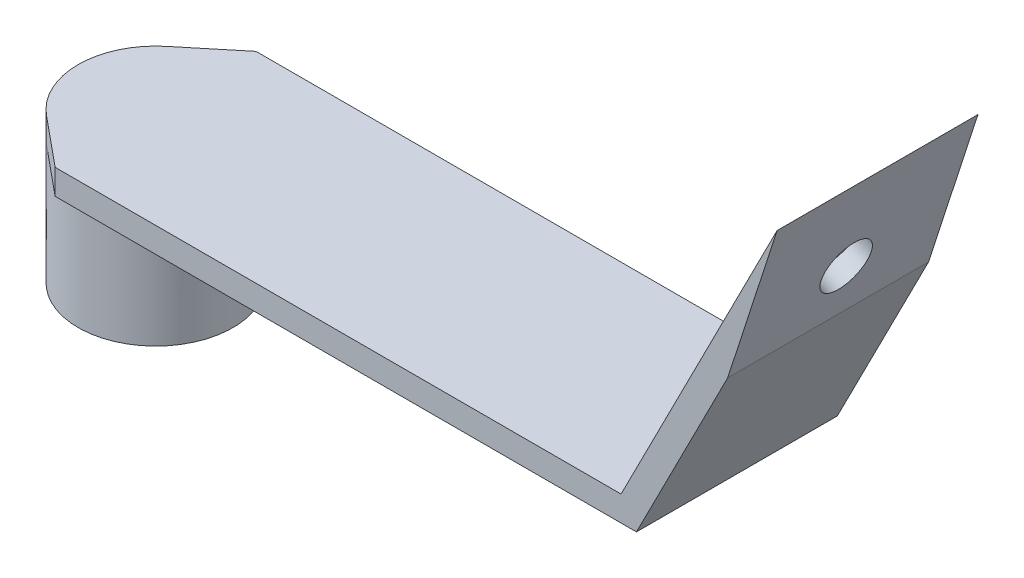
ISO-10303-21;
HEADER;
FILE_DESCRIPTION(('STEP AP214'),'2;1');
FILE_NAME('part.step','',(''),(''),'','','');
FILE_SCHEMA(('AUTOMOTIVE_DESIGN { 1 0 10303 214 1 1 1 1 }'));
ENDSEC;
DATA;
#1=APPLICATION_CONTEXT('core data for automotive mechanical design processes');
#2=APPLICATION_PROTOCOL_DEFINITION('international standard','automotive_design',2000,#1);
#3=PRODUCT_CONTEXT('',#1,'mechanical');
#4=PRODUCT('Part','Part','',(#3));
#5=PRODUCT_RELATED_PRODUCT_CATEGORY('part','',(#4));
#6=PRODUCT_DEFINITION_FORMATION('','',#4);
#7=PRODUCT_DEFINITION_CONTEXT('part definition',#1,'design');
#8=PRODUCT_DEFINITION('design','',#6,#7);
#9=PRODUCT_DEFINITION_SHAPE('','',#8);
#10=(LENGTH_UNIT() NAMED_UNIT(*) SI_UNIT(.MILLI.,.METRE.));
#11=(NAMED_UNIT(*) PLANE_ANGLE_UNIT() SI_UNIT($,.RADIAN.));
#12=(NAMED_UNIT(*) SI_UNIT($,.STERADIAN.) SOLID_ANGLE_UNIT());
#13=UNCERTAINTY_MEASURE_WITH_UNIT(LENGTH_MEASURE(1.E-05),#10,'distance_accuracy_value','');
#14=(GEOMETRIC_REPRESENTATION_CONTEXT(3) GLOBAL_UNCERTAINTY_ASSIGNED_CONTEXT((#13)) GLOBAL_UNIT_ASSIGNED_CONTEXT((#10,
#11,#12)) REPRESENTATION_CONTEXT('',''));
#15=CARTESIAN_POINT('',(0.,0.,0.));
#16=DIRECTION('',(0.,0.,1.));
#17=DIRECTION('',(1.,0.,0.));
#18=AXIS2_PLACEMENT_3D('',#15,#16,#17);
#19=CARTESIAN_POINT('',(-92.4958191725442,-22.422180744699,12.7));
#20=DIRECTION('',(0.,1.,0.));
#21=DIRECTION('',(-1.,0.,0.));
#22=AXIS2_PLACEMENT_3D('',#19,#20,#21);
#23=CYLINDRICAL_SURFACE('',#22,9.80144867591482);
#24=CARTESIAN_POINT('',(-92.4958191725442,-22.422180744699,12.7));
#25=DIRECTION('',(0.,1.,0.));
#26=DIRECTION('',(-1.,0.,0.));
#27=AXIS2_PLACEMENT_3D('',#24,#25,#26);
#28=CIRCLE('',#27,9.80144867591482);
#29=CARTESIAN_POINT('',(-102.297267848459,-22.422180744699,12.7));
#30=VERTEX_POINT('',#29);
#31=EDGE_CURVE('E167',#30,#30,#28,.T.);
#32=ORIENTED_EDGE('',*,*,#31,.T.);
#33=EDGE_LOOP('',(#32));
#34=FACE_BOUND('',#33,.T.);
#35=CARTESIAN_POINT('',(-92.4958191725442,-3.42218074469901,12.7));
#36=DIRECTION('',(0.,1.,0.));
#37=DIRECTION('',(-1.,0.,0.));
#38=AXIS2_PLACEMENT_3D('',#35,#36,#37);
#39=CIRCLE('',#38,9.80144867591482);
#40=CARTESIAN_POINT('',(-98.728606183856,-3.42218074469901,5.13555935853712));
#41=VERTEX_POINT('',#40);
#42=CARTESIAN_POINT('',(-98.7286016184483,-3.42218074469902,20.2644444031666));
#43=VERTEX_POINT('',#42);
#44=EDGE_CURVE('E168',#41,#43,#39,.T.);
#45=ORIENTED_EDGE('',*,*,#44,.F.);
#46=DIRECTION('',(0.,1.,0.));
#47=VECTOR('',#46,1.);
#48=CARTESIAN_POINT('',(-98.7286061838552,-6.59718074470012,5.13555935853658));
#49=LINE('',#48,#47);
#50=CARTESIAN_POINT('',(-98.7286061838552,-6.59718074470012,5.13555935853658));
#51=VERTEX_POINT('',#50);
#52=EDGE_CURVE('E176',#51,#41,#49,.T.);
#53=ORIENTED_EDGE('',*,*,#52,.F.);
#54=CARTESIAN_POINT('',(-92.4958191725442,-6.59718074469901,12.7));
#55=DIRECTION('',(0.,1.,0.));
#56=DIRECTION('',(-1.,0.,0.));
#57=AXIS2_PLACEMENT_3D('',#54,#55,#56);
#58=CIRCLE('',#57,9.80144867591482);
#59=CARTESIAN_POINT('',(-98.7286016184483,-6.59718074469902,20.2644444031666));
#60=VERTEX_POINT('',#59);
#61=EDGE_CURVE('E118',#60,#51,#58,.T.);
#62=ORIENTED_EDGE('',*,*,#61,.F.);
#63=DIRECTION('',(0.,1.,0.));
#64=VECTOR('',#63,1.);
#65=CARTESIAN_POINT('',(-98.7286016184483,-6.59718074469902,20.2644444031666));
#66=LINE('',#65,#64);
#67=EDGE_CURVE('E175',#60,#43,#66,.T.);
#68=ORIENTED_EDGE('',*,*,#67,.T.);
#69=EDGE_LOOP('',(#45,#53,#62,#68));
#70=FACE_BOUND('',#69,.T.);
#71=ADVANCED_FACE('F34',(#34,#70),#23,.T.);
#72=CARTESIAN_POINT('',(-92.4958191725442,-22.422180744699,12.7));
#73=DIRECTION('',(0.,1.,0.));
#74=DIRECTION('',(-1.,0.,0.));
#75=AXIS2_PLACEMENT_3D('',#72,#73,#74);
#76=CYLINDRICAL_SURFACE('',#75,7.07136802942698);
#77=CARTESIAN_POINT('',(-92.4958191725442,-22.422180744699,12.7));
#78=DIRECTION('',(0.,1.,0.));
#79=DIRECTION('',(-1.,0.,0.));
#80=AXIS2_PLACEMENT_3D('',#77,#78,#79);
#81=CIRCLE('',#80,7.07136802942698);
#82=CARTESIAN_POINT('',(-99.5671872019712,-22.422180744699,12.7));
#83=VERTEX_POINT('',#82);
#84=EDGE_CURVE('E170',#83,#83,#81,.T.);
#85=ORIENTED_EDGE('',*,*,#84,.F.);
#86=EDGE_LOOP('',(#85));
#87=FACE_BOUND('',#86,.T.);
#88=CARTESIAN_POINT('',(-92.4958191725442,-6.59718074469901,12.7));
#89=DIRECTION('',(0.,1.,0.));
#90=DIRECTION('',(-1.,0.,0.));
#91=AXIS2_PLACEMENT_3D('',#88,#89,#90);
#92=CIRCLE('',#91,7.07136802942698);
#93=CARTESIAN_POINT('',(-99.5671872019712,-6.59718074469901,12.7));
#94=VERTEX_POINT('',#93);
#95=EDGE_CURVE('E164',#94,#94,#92,.T.);
#96=ORIENTED_EDGE('',*,*,#95,.T.);
#97=EDGE_LOOP('',(#96));
#98=FACE_BOUND('',#97,.T.);
#99=ADVANCED_FACE('F205',(#87,#98),#76,.F.);
#100=CARTESIAN_POINT('',(-92.4958191725442,-6.59718074469901,25.4));
#101=DIRECTION('',(0.,1.,0.));
#102=DIRECTION('',(-1.,0.,0.));
#103=AXIS2_PLACEMENT_3D('',#100,#101,#102);
#104=PLANE('',#103);
#105=ORIENTED_EDGE('',*,*,#95,.F.);
#106=EDGE_LOOP('',(#105));
#107=FACE_BOUND('',#106,.T.);
#108=ADVANCED_FACE('F211',(#107),#104,.F.);
#109=DIRECTION('',(1.,0.,0.));
#110=VECTOR('',#109,1.);
#111=CARTESIAN_POINT('',(-92.4958191725442,-6.59718074469901,25.4));
#112=LINE('',#111,#110);
#113=CARTESIAN_POINT('',(-92.4958191725442,-6.59718074469901,25.3999999999982));
#114=VERTEX_POINT('',#113);
#115=CARTESIAN_POINT('',(-18.9958191725442,-6.59718074469901,25.4));
#116=VERTEX_POINT('',#115);
#117=EDGE_CURVE('E86',#114,#116,#112,.T.);
#118=ORIENTED_EDGE('',*,*,#117,.F.);
#119=DIRECTION('',(0.771767612276631,0.,0.635904672604954));
#120=VECTOR('',#119,1.);
#121=CARTESIAN_POINT('',(-49.8685480208359,-6.59718074469892,60.523112805691));
#122=LINE('',#121,#120);
#123=EDGE_CURVE('E122',#60,#114,#122,.T.);
#124=ORIENTED_EDGE('',*,*,#123,.F.);
#125=ORIENTED_EDGE('',*,*,#61,.T.);
#126=DIRECTION('',(-0.771767612276638,0.,0.635904672604939));
#127=VECTOR('',#126,1.);
#128=CARTESIAN_POINT('',(-37.4029739982157,-6.59718074469813,-45.3942315227694));
#129=LINE('',#128,#127);
#130=CARTESIAN_POINT('',(-92.4958191725442,-6.59718074469901,-2.70616862252382E-12));
#131=VERTEX_POINT('',#130);
#132=EDGE_CURVE('E112',#131,#51,#129,.T.);
#133=ORIENTED_EDGE('',*,*,#132,.F.);
#134=DIRECTION('',(1.,0.,0.));
#135=VECTOR('',#134,1.);
#136=CARTESIAN_POINT('',(-92.4958191725442,-6.59718074469901,0.));
#137=LINE('',#136,#135);
#138=CARTESIAN_POINT('',(-18.9958191725442,-6.59718074469901,0.));
#139=VERTEX_POINT('',#138);
#140=EDGE_CURVE('E117',#131,#139,#137,.T.);
#141=ORIENTED_EDGE('',*,*,#140,.T.);
#142=DIRECTION('',(0.,0.,-1.));
#143=VECTOR('',#142,1.);
#144=CARTESIAN_POINT('',(-18.9958191725442,-6.59718074469901,25.4));
#145=LINE('',#144,#143);
#146=EDGE_CURVE('E11',#116,#139,#145,.T.);
#147=ORIENTED_EDGE('',*,*,#146,.F.);
#148=EDGE_LOOP('',(#118,#124,#125,#133,#141,#147));
#149=FACE_BOUND('',#148,.T.);
#150=ADVANCED_FACE('F36',(#149),#104,.F.);
#151=CARTESIAN_POINT('',(-18.9958191725442,-6.59718074469901,25.4));
#152=DIRECTION('',(-0.891006524188369,0.453990499739544,0.));
#153=DIRECTION('',(-0.453990499739544,-0.891006524188369,0.));
#154=AXIS2_PLACEMENT_3D('',#151,#152,#153);
#155=PLANE('',#154);
#156=DIRECTION('',(0.453990499739544,0.891006524188369,0.));
#157=VECTOR('',#156,1.);
#158=CARTESIAN_POINT('',(-18.9958191725442,-6.59718074469901,0.));
#159=LINE('',#158,#157);
#160=CARTESIAN_POINT('',(-7.46446047915981,16.0343849696856,0.));
#161=VERTEX_POINT('',#160);
#162=EDGE_CURVE('E128',#139,#161,#159,.T.);
#163=ORIENTED_EDGE('',*,*,#162,.T.);
#164=DIRECTION('',(0.,0.,-1.));
#165=VECTOR('',#164,1.);
#166=CARTESIAN_POINT('',(-7.46446047915981,16.0343849696856,25.4));
#167=LINE('',#166,#165);
#168=CARTESIAN_POINT('',(-7.46446047915981,16.0343849696856,25.4));
#169=VERTEX_POINT('',#168);
#170=EDGE_CURVE('E42',#169,#161,#167,.T.);
#171=ORIENTED_EDGE('',*,*,#170,.F.);
#172=DIRECTION('',(0.453990499739544,0.891006524188369,0.));
#173=VECTOR('',#172,1.);
#174=CARTESIAN_POINT('',(-18.9958191725442,-6.59718074469901,25.4));
#175=LINE('',#174,#173);
#176=EDGE_CURVE('E157',#116,#169,#175,.T.);
#177=ORIENTED_EDGE('',*,*,#176,.F.);
#178=ORIENTED_EDGE('',*,*,#146,.T.);
#179=EDGE_LOOP('',(#163,#171,#177,#178));
#180=FACE_BOUND('',#179,.T.);
#181=ADVANCED_FACE('F201',(#180),#155,.F.);
#182=CARTESIAN_POINT('',(-7.46446047915981,16.0343849696856,25.4));
#183=DIRECTION('',(-0.95114167721911,0.308754773010586,0.));
#184=DIRECTION('',(-0.308754773010586,-0.95114167721911,0.));
#185=AXIS2_PLACEMENT_3D('',#182,#183,#184);
#186=PLANE('',#185);
#187=CARTESIAN_POINT('',(-5.17908782947511,23.0746426923322,12.7));
#188=DIRECTION('',(-0.95114167721911,0.308754773010586,0.));
#189=DIRECTION('',(0.308754773010586,0.95114167721911,0.));
#190=AXIS2_PLACEMENT_3D('',#187,#188,#189);
#191=ELLIPSE('',#190,3.21471727408513,3.175);
#192=CARTESIAN_POINT('',(-4.18652852722175,26.1322942721908,12.7));
#193=VERTEX_POINT('',#192);
#194=EDGE_CURVE('E182',#193,#193,#191,.T.);
#195=ORIENTED_EDGE('',*,*,#194,.T.);
#196=EDGE_LOOP('',(#195));
#197=FACE_BOUND('',#196,.T.);
#198=DIRECTION('',(0.308754773010586,0.95114167721911,0.));
#199=VECTOR('',#198,1.);
#200=CARTESIAN_POINT('',(-7.46446047915981,16.0343849696856,0.));
#201=LINE('',#200,#199);
#202=CARTESIAN_POINT('',(-1.20885062046166,35.3052490117665,0.));
#203=VERTEX_POINT('',#202);
#204=EDGE_CURVE('E130',#161,#203,#201,.T.);
#205=ORIENTED_EDGE('',*,*,#204,.T.);
#206=DIRECTION('',(0.,0.,-1.));
#207=VECTOR('',#206,1.);
#208=CARTESIAN_POINT('',(-1.20885062046166,35.3052490117665,25.4));
#209=LINE('',#208,#207);
#210=CARTESIAN_POINT('',(-1.20885062046166,35.3052490117665,25.4));
#211=VERTEX_POINT('',#210);
#212=EDGE_CURVE('E141',#211,#203,#209,.T.);
#213=ORIENTED_EDGE('',*,*,#212,.F.);
#214=DIRECTION('',(0.308754773010586,0.95114167721911,0.));
#215=VECTOR('',#214,1.);
#216=CARTESIAN_POINT('',(-7.46446047915981,16.0343849696856,25.4));
#217=LINE('',#216,#215);
#218=EDGE_CURVE('E149',#169,#211,#217,.T.);
#219=ORIENTED_EDGE('',*,*,#218,.F.);
#220=ORIENTED_EDGE('',*,*,#170,.T.);
#221=EDGE_LOOP('',(#205,#213,#219,#220));
#222=FACE_BOUND('',#221,.T.);
#223=ADVANCED_FACE('F147',(#197,#222),#186,.F.);
#224=CARTESIAN_POINT('',(-20.9414616748885,-3.42218074469901,25.4));
#225=DIRECTION('',(0.891006524188369,-0.453990499739544,0.));
#226=DIRECTION('',(0.453990499739544,0.891006524188369,0.));
#227=AXIS2_PLACEMENT_3D('',#224,#225,#226);
#228=PLANE('',#227);
#229=CARTESIAN_POINT('',(-6.97452996715387,23.9894661545742,12.7));
#230=DIRECTION('',(-0.891006524188369,0.453990499739544,0.));
#231=DIRECTION('',(-0.453990499739544,-0.891006524188369,0.));
#232=AXIS2_PLACEMENT_3D('',#229,#230,#231);
#233=CIRCLE('',#232,3.175);
#234=CARTESIAN_POINT('',(-8.41594980382692,21.1605204402761,12.7));
#235=VERTEX_POINT('',#234);
#236=EDGE_CURVE('E186',#235,#235,#233,.T.);
#237=ORIENTED_EDGE('',*,*,#236,.F.);
#238=EDGE_LOOP('',(#237));
#239=FACE_BOUND('',#238,.T.);
#240=DIRECTION('',(-0.453990499739544,-0.891006524188369,0.));
#241=VECTOR('',#240,1.);
#242=CARTESIAN_POINT('',(-20.9414616748885,-3.42218074469901,0.));
#243=LINE('',#242,#241);
#244=CARTESIAN_POINT('',(-20.9414616748885,-3.42218074469901,0.));
#245=VERTEX_POINT('',#244);
#246=EDGE_CURVE('E79',#203,#245,#243,.T.);
#247=ORIENTED_EDGE('',*,*,#246,.T.);
#248=DIRECTION('',(0.,0.,-1.));
#249=VECTOR('',#248,1.);
#250=CARTESIAN_POINT('',(-20.9414616748885,-3.42218074469901,25.4));
#251=LINE('',#250,#249);
#252=CARTESIAN_POINT('',(-20.9414616748885,-3.42218074469901,25.4));
#253=VERTEX_POINT('',#252);
#254=EDGE_CURVE('E139',#253,#245,#251,.T.);
#255=ORIENTED_EDGE('',*,*,#254,.F.);
#256=DIRECTION('',(-0.453990499739544,-0.891006524188369,0.));
#257=VECTOR('',#256,1.);
#258=CARTESIAN_POINT('',(-20.9414616748885,-3.42218074469901,25.4));
#259=LINE('',#258,#257);
#260=EDGE_CURVE('E58',#211,#253,#259,.T.);
#261=ORIENTED_EDGE('',*,*,#260,.F.);
#262=ORIENTED_EDGE('',*,*,#212,.T.);
#263=EDGE_LOOP('',(#247,#255,#261,#262));
#264=FACE_BOUND('',#263,.T.);
#265=ADVANCED_FACE('F155',(#239,#264),#228,.F.);
#266=CARTESIAN_POINT('',(-92.4958191725442,-3.42218074469901,25.4));
#267=DIRECTION('',(0.,-1.,0.));
#268=DIRECTION('',(1.,0.,0.));
#269=AXIS2_PLACEMENT_3D('',#266,#267,#268);
#270=PLANE('',#269);
#271=ORIENTED_EDGE('',*,*,#44,.T.);
#272=DIRECTION('',(0.771767612276631,0.,0.635904672604954));
#273=VECTOR('',#272,1.);
#274=CARTESIAN_POINT('',(-49.8685480208359,-3.42218074469892,60.523112805691));
#275=LINE('',#274,#273);
#276=CARTESIAN_POINT('',(-92.4958191725442,-3.42218074469901,25.3999999999982));
#277=VERTEX_POINT('',#276);
#278=EDGE_CURVE('E123',#43,#277,#275,.T.);
#279=ORIENTED_EDGE('',*,*,#278,.T.);
#280=DIRECTION('',(-1.,0.,0.));
#281=VECTOR('',#280,1.);
#282=CARTESIAN_POINT('',(-92.4958191725442,-3.42218074469901,25.4));
#283=LINE('',#282,#281);
#284=EDGE_CURVE('E142',#253,#277,#283,.T.);
#285=ORIENTED_EDGE('',*,*,#284,.F.);
#286=ORIENTED_EDGE('',*,*,#254,.T.);
#287=DIRECTION('',(-1.,0.,0.));
#288=VECTOR('',#287,1.);
#289=CARTESIAN_POINT('',(-92.4958191725442,-3.42218074469901,0.));
#290=LINE('',#289,#288);
#291=CARTESIAN_POINT('',(-92.4958191725442,-3.42218074469901,-2.70616862252382E-12));
#292=VERTEX_POINT('',#291);
#293=EDGE_CURVE('E136',#245,#292,#290,.T.);
#294=ORIENTED_EDGE('',*,*,#293,.T.);
#295=DIRECTION('',(-0.771767612276638,0.,0.635904672604939));
#296=VECTOR('',#295,1.);
#297=CARTESIAN_POINT('',(-37.4029739982157,-3.42218074469813,-45.3942315227694));
#298=LINE('',#297,#296);
#299=EDGE_CURVE('E49',#292,#41,#298,.T.);
#300=ORIENTED_EDGE('',*,*,#299,.T.);
#301=EDGE_LOOP('',(#271,#279,#285,#286,#294,#300));
#302=FACE_BOUND('',#301,.T.);
#303=ADVANCED_FACE('F152',(#302),#270,.F.);
#304=CARTESIAN_POINT('',(0.,0.,25.4));
#305=DIRECTION('',(0.,0.,1.));
#306=DIRECTION('',(1.,0.,0.));
#307=AXIS2_PLACEMENT_3D('',#304,#305,#306);
#308=PLANE('',#307);
#309=DIRECTION('',(0.,-1.,0.));
#310=VECTOR('',#309,1.);
#311=CARTESIAN_POINT('',(-92.4958191725442,-3.42218074469901,25.4));
#312=LINE('',#311,#310);
#313=EDGE_CURVE('E138',#277,#114,#312,.T.);
#314=ORIENTED_EDGE('',*,*,#313,.T.);
#315=ORIENTED_EDGE('',*,*,#117,.T.);
#316=ORIENTED_EDGE('',*,*,#176,.T.);
#317=ORIENTED_EDGE('',*,*,#218,.T.);
#318=ORIENTED_EDGE('',*,*,#260,.T.);
#319=ORIENTED_EDGE('',*,*,#284,.T.);
#320=EDGE_LOOP('',(#314,#315,#316,#317,#318,#319));
#321=FACE_BOUND('',#320,.T.);
#322=ADVANCED_FACE('F199',(#321),#308,.T.);
#323=CARTESIAN_POINT('',(0.,0.,0.));
#324=DIRECTION('',(0.,0.,1.));
#325=DIRECTION('',(1.,0.,0.));
#326=AXIS2_PLACEMENT_3D('',#323,#324,#325);
#327=PLANE('',#326);
#328=DIRECTION('',(0.,-1.,0.));
#329=VECTOR('',#328,1.);
#330=CARTESIAN_POINT('',(-92.4958191725442,-3.42218074469901,0.));
#331=LINE('',#330,#329);
#332=EDGE_CURVE('E109',#292,#131,#331,.T.);
#333=ORIENTED_EDGE('',*,*,#332,.F.);
#334=ORIENTED_EDGE('',*,*,#293,.F.);
#335=ORIENTED_EDGE('',*,*,#246,.F.);
#336=ORIENTED_EDGE('',*,*,#204,.F.);
#337=ORIENTED_EDGE('',*,*,#162,.F.);
#338=ORIENTED_EDGE('',*,*,#140,.F.);
#339=EDGE_LOOP('',(#333,#334,#335,#336,#337,#338));
#340=FACE_BOUND('',#339,.T.);
#341=ADVANCED_FACE('F126',(#340),#327,.F.);
#342=CARTESIAN_POINT('',(-92.4958191725442,-22.422180744699,12.7));
#343=DIRECTION('',(0.,1.,0.));
#344=DIRECTION('',(-1.,0.,0.));
#345=AXIS2_PLACEMENT_3D('',#342,#343,#344);
#346=PLANE('',#345);
#347=ORIENTED_EDGE('',*,*,#84,.T.);
#348=EDGE_LOOP('',(#347));
#349=FACE_BOUND('',#348,.T.);
#350=ORIENTED_EDGE('',*,*,#31,.F.);
#351=EDGE_LOOP('',(#350));
#352=FACE_BOUND('',#351,.T.);
#353=ADVANCED_FACE('F217',(#349,#352),#346,.F.);
#354=CARTESIAN_POINT('',(-49.8685480208359,-6.59718074469892,60.523112805691));
#355=DIRECTION('',(-0.635904672604958,0.,0.771767612276637));
#356=DIRECTION('',(0.771767612276637,0.,0.635904672604958));
#357=AXIS2_PLACEMENT_3D('',#354,#355,#356);
#358=PLANE('',#357);
#359=ORIENTED_EDGE('',*,*,#278,.F.);
#360=ORIENTED_EDGE('',*,*,#67,.F.);
#361=ORIENTED_EDGE('',*,*,#123,.T.);
#362=ORIENTED_EDGE('',*,*,#313,.F.);
#363=EDGE_LOOP('',(#359,#360,#361,#362));
#364=FACE_BOUND('',#363,.T.);
#365=ADVANCED_FACE('F224',(#364),#358,.T.);
#366=CARTESIAN_POINT('',(-37.4029739982157,-6.59718074469813,-45.3942315227694));
#367=DIRECTION('',(-0.635904672604946,0.,-0.771767612276647));
#368=DIRECTION('',(-0.771767612276647,0.,0.635904672604946));
#369=AXIS2_PLACEMENT_3D('',#366,#367,#368);
#370=PLANE('',#369);
#371=ORIENTED_EDGE('',*,*,#299,.F.);
#372=ORIENTED_EDGE('',*,*,#332,.T.);
#373=ORIENTED_EDGE('',*,*,#132,.T.);
#374=ORIENTED_EDGE('',*,*,#52,.T.);
#375=EDGE_LOOP('',(#371,#372,#373,#374));
#376=FACE_BOUND('',#375,.T.);
#377=ADVANCED_FACE('F111',(#376),#370,.T.);
#378=CARTESIAN_POINT('',(-4.1455842528558,22.5480463179012,12.7));
#379=DIRECTION('',(-0.891006524188369,0.453990499739544,0.));
#380=DIRECTION('',(-0.453990499739544,-0.891006524188369,0.));
#381=AXIS2_PLACEMENT_3D('',#378,#379,#380);
#382=CYLINDRICAL_SURFACE('',#381,3.175);
#383=ORIENTED_EDGE('',*,*,#236,.T.);
#384=EDGE_LOOP('',(#383));
#385=FACE_BOUND('',#384,.T.);
#386=ORIENTED_EDGE('',*,*,#194,.F.);
#387=EDGE_LOOP('',(#386));
#388=FACE_BOUND('',#387,.T.);
#389=ADVANCED_FACE('F190',(#385,#388),#382,.F.);
#390=CLOSED_SHELL('',(#71,#99,#108,#150,#181,#223,#265,#303,#322,#341,#353,#365,#377,#389));
#391=MANIFOLD_SOLID_BREP('B2',#390);
#392=ADVANCED_BREP_SHAPE_REPRESENTATION('',(#18,#391),#14);
#393=SHAPE_DEFINITION_REPRESENTATION(#9,#392);
ENDSEC;
END-ISO-10303-21;
